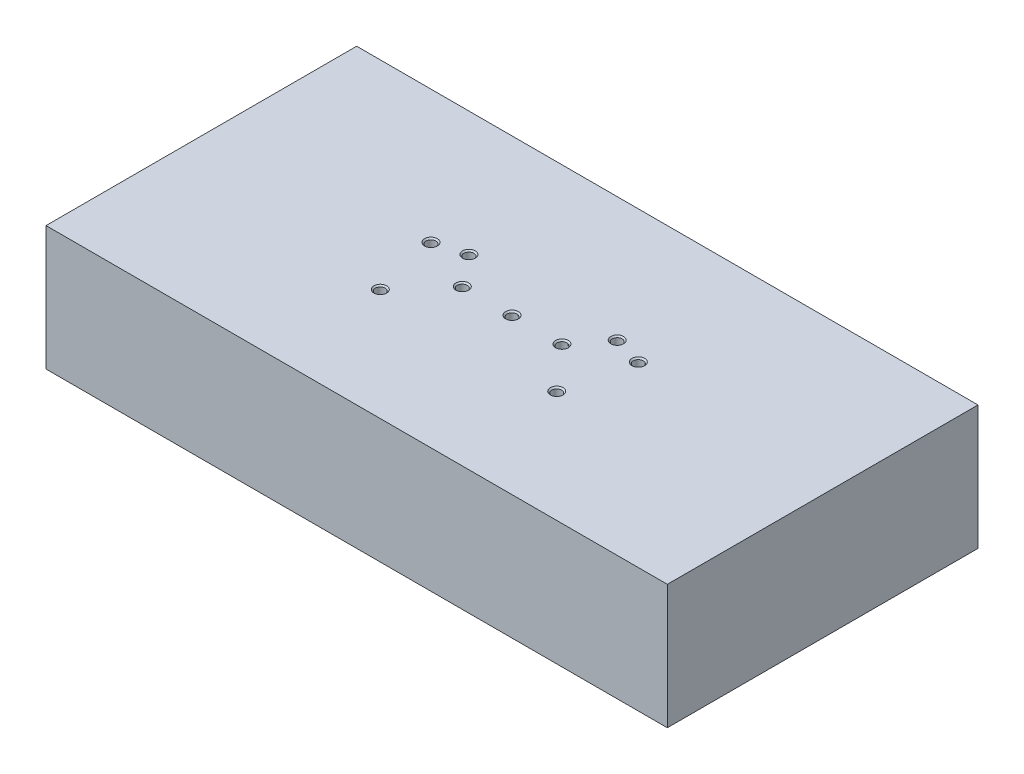
ISO-10303-21;
HEADER;
FILE_DESCRIPTION(('STEP AP214'),'2;1');
FILE_NAME('part.step','',(''),(''),'','','');
FILE_SCHEMA(('AUTOMOTIVE_DESIGN { 1 0 10303 214 1 1 1 1 }'));
ENDSEC;
DATA;
#1=APPLICATION_CONTEXT('core data for automotive mechanical design processes');
#2=APPLICATION_PROTOCOL_DEFINITION('international standard','automotive_design',2000,#1);
#3=PRODUCT_CONTEXT('',#1,'mechanical');
#4=PRODUCT('Part','Part','',(#3));
#5=PRODUCT_RELATED_PRODUCT_CATEGORY('part','',(#4));
#6=PRODUCT_DEFINITION_FORMATION('','',#4);
#7=PRODUCT_DEFINITION_CONTEXT('part definition',#1,'design');
#8=PRODUCT_DEFINITION('design','',#6,#7);
#9=PRODUCT_DEFINITION_SHAPE('','',#8);
#10=(LENGTH_UNIT() NAMED_UNIT(*) SI_UNIT(.MILLI.,.METRE.));
#11=(NAMED_UNIT(*) PLANE_ANGLE_UNIT() SI_UNIT($,.RADIAN.));
#12=(NAMED_UNIT(*) SI_UNIT($,.STERADIAN.) SOLID_ANGLE_UNIT());
#13=UNCERTAINTY_MEASURE_WITH_UNIT(LENGTH_MEASURE(1.E-05),#10,'distance_accuracy_value','');
#14=(GEOMETRIC_REPRESENTATION_CONTEXT(3) GLOBAL_UNCERTAINTY_ASSIGNED_CONTEXT((#13)) GLOBAL_UNIT_ASSIGNED_CONTEXT((#10,
#11,#12)) REPRESENTATION_CONTEXT('',''));
#15=CARTESIAN_POINT('',(0.,0.,0.));
#16=DIRECTION('',(0.,0.,1.));
#17=DIRECTION('',(1.,0.,0.));
#18=AXIS2_PLACEMENT_3D('',#15,#16,#17);
#19=CARTESIAN_POINT('',(-0.25,10.,0.));
#20=DIRECTION('',(1.,0.,0.));
#21=DIRECTION('',(0.,0.,-1.));
#22=AXIS2_PLACEMENT_3D('',#19,#20,#21);
#23=PLANE('',#22);
#24=DIRECTION('',(0.,0.,1.));
#25=VECTOR('',#24,1.);
#26=CARTESIAN_POINT('',(-0.25,0.,0.));
#27=LINE('',#26,#25);
#28=CARTESIAN_POINT('',(-0.250000000000001,0.,-7.));
#29=VERTEX_POINT('',#28);
#30=CARTESIAN_POINT('',(-0.25,0.,-3.));
#31=VERTEX_POINT('',#30);
#32=EDGE_CURVE('E178',#29,#31,#27,.T.);
#33=ORIENTED_EDGE('',*,*,#32,.F.);
#34=DIRECTION('',(0.,-1.,0.));
#35=VECTOR('',#34,1.);
#36=CARTESIAN_POINT('',(-0.250000000000001,10.,-7.));
#37=LINE('',#36,#35);
#38=CARTESIAN_POINT('',(-0.250000000000001,10.,-7.));
#39=VERTEX_POINT('',#38);
#40=EDGE_CURVE('E11',#39,#29,#37,.T.);
#41=ORIENTED_EDGE('',*,*,#40,.F.);
#42=DIRECTION('',(0.,0.,1.));
#43=VECTOR('',#42,1.);
#44=CARTESIAN_POINT('',(-0.25,10.,0.));
#45=LINE('',#44,#43);
#46=CARTESIAN_POINT('',(-0.25,10.,-3.));
#47=VERTEX_POINT('',#46);
#48=EDGE_CURVE('E198',#39,#47,#45,.T.);
#49=ORIENTED_EDGE('',*,*,#48,.T.);
#50=DIRECTION('',(0.,-1.,0.));
#51=VECTOR('',#50,1.);
#52=CARTESIAN_POINT('',(-0.25,10.,-3.));
#53=LINE('',#52,#51);
#54=EDGE_CURVE('E111',#47,#31,#53,.T.);
#55=ORIENTED_EDGE('',*,*,#54,.T.);
#56=EDGE_LOOP('',(#33,#41,#49,#55));
#57=FACE_BOUND('',#56,.T.);
#58=ADVANCED_FACE('F46',(#57),#23,.T.);
#59=CARTESIAN_POINT('',(0.,10.,-7.));
#60=DIRECTION('',(0.,0.,-1.));
#61=DIRECTION('',(-1.,0.,0.));
#62=AXIS2_PLACEMENT_3D('',#59,#60,#61);
#63=PLANE('',#62);
#64=DIRECTION('',(1.,0.,0.));
#65=VECTOR('',#64,1.);
#66=CARTESIAN_POINT('',(0.,0.,-7.));
#67=LINE('',#66,#65);
#68=CARTESIAN_POINT('',(0.249999999999999,0.,-7.));
#69=VERTEX_POINT('',#68);
#70=EDGE_CURVE('E181',#29,#69,#67,.T.);
#71=ORIENTED_EDGE('',*,*,#70,.T.);
#72=DIRECTION('',(0.,-1.,0.));
#73=VECTOR('',#72,1.);
#74=CARTESIAN_POINT('',(0.249999999999999,10.,-7.));
#75=LINE('',#74,#73);
#76=CARTESIAN_POINT('',(0.249999999999999,10.,-7.));
#77=VERTEX_POINT('',#76);
#78=EDGE_CURVE('E56',#77,#69,#75,.T.);
#79=ORIENTED_EDGE('',*,*,#78,.F.);
#80=DIRECTION('',(1.,0.,0.));
#81=VECTOR('',#80,1.);
#82=CARTESIAN_POINT('',(0.,10.,-7.));
#83=LINE('',#82,#81);
#84=EDGE_CURVE('E250',#39,#77,#83,.T.);
#85=ORIENTED_EDGE('',*,*,#84,.F.);
#86=ORIENTED_EDGE('',*,*,#40,.T.);
#87=EDGE_LOOP('',(#71,#79,#85,#86));
#88=FACE_BOUND('',#87,.T.);
#89=ADVANCED_FACE('F257',(#88),#63,.F.);
#90=CARTESIAN_POINT('',(0.25,10.,0.));
#91=DIRECTION('',(1.,0.,0.));
#92=DIRECTION('',(0.,0.,-1.));
#93=AXIS2_PLACEMENT_3D('',#90,#91,#92);
#94=PLANE('',#93);
#95=DIRECTION('',(0.,0.,1.));
#96=VECTOR('',#95,1.);
#97=CARTESIAN_POINT('',(0.25,0.,0.));
#98=LINE('',#97,#96);
#99=CARTESIAN_POINT('',(0.25,0.,-3.));
#100=VERTEX_POINT('',#99);
#101=EDGE_CURVE('E184',#69,#100,#98,.T.);
#102=ORIENTED_EDGE('',*,*,#101,.T.);
#103=DIRECTION('',(0.,-1.,0.));
#104=VECTOR('',#103,1.);
#105=CARTESIAN_POINT('',(0.25,10.,-3.));
#106=LINE('',#105,#104);
#107=CARTESIAN_POINT('',(0.25,10.,-3.));
#108=VERTEX_POINT('',#107);
#109=EDGE_CURVE('E204',#108,#100,#106,.T.);
#110=ORIENTED_EDGE('',*,*,#109,.F.);
#111=DIRECTION('',(0.,0.,1.));
#112=VECTOR('',#111,1.);
#113=CARTESIAN_POINT('',(0.25,10.,0.));
#114=LINE('',#113,#112);
#115=EDGE_CURVE('E156',#77,#108,#114,.T.);
#116=ORIENTED_EDGE('',*,*,#115,.F.);
#117=ORIENTED_EDGE('',*,*,#78,.T.);
#118=EDGE_LOOP('',(#102,#110,#116,#117));
#119=FACE_BOUND('',#118,.T.);
#120=ADVANCED_FACE('F255',(#119),#94,.F.);
#121=CARTESIAN_POINT('',(0.,10.,-3.));
#122=DIRECTION('',(0.,0.,-1.));
#123=DIRECTION('',(-1.,0.,0.));
#124=AXIS2_PLACEMENT_3D('',#121,#122,#123);
#125=PLANE('',#124);
#126=DIRECTION('',(1.,0.,0.));
#127=VECTOR('',#126,1.);
#128=CARTESIAN_POINT('',(0.,0.,-3.));
#129=LINE('',#128,#127);
#130=CARTESIAN_POINT('',(11.7,0.,-3.));
#131=VERTEX_POINT('',#130);
#132=EDGE_CURVE('E187',#100,#131,#129,.T.);
#133=ORIENTED_EDGE('',*,*,#132,.T.);
#134=DIRECTION('',(0.,-1.,0.));
#135=VECTOR('',#134,1.);
#136=CARTESIAN_POINT('',(11.7,10.,-3.));
#137=LINE('',#136,#135);
#138=CARTESIAN_POINT('',(11.7,10.,-3.));
#139=VERTEX_POINT('',#138);
#140=EDGE_CURVE('E140',#139,#131,#137,.T.);
#141=ORIENTED_EDGE('',*,*,#140,.F.);
#142=DIRECTION('',(1.,0.,0.));
#143=VECTOR('',#142,1.);
#144=CARTESIAN_POINT('',(0.,10.,-3.));
#145=LINE('',#144,#143);
#146=EDGE_CURVE('E154',#108,#139,#145,.T.);
#147=ORIENTED_EDGE('',*,*,#146,.F.);
#148=ORIENTED_EDGE('',*,*,#109,.T.);
#149=EDGE_LOOP('',(#133,#141,#147,#148));
#150=FACE_BOUND('',#149,.T.);
#151=ADVANCED_FACE('F307',(#150),#125,.F.);
#152=CARTESIAN_POINT('',(11.7,10.,0.));
#153=DIRECTION('',(1.,0.,0.));
#154=DIRECTION('',(0.,0.,-1.));
#155=AXIS2_PLACEMENT_3D('',#152,#153,#154);
#156=PLANE('',#155);
#157=DIRECTION('',(0.,0.,1.));
#158=VECTOR('',#157,1.);
#159=CARTESIAN_POINT('',(11.7,0.,0.));
#160=LINE('',#159,#158);
#161=CARTESIAN_POINT('',(11.7,0.,3.));
#162=VERTEX_POINT('',#161);
#163=EDGE_CURVE('E136',#131,#162,#160,.T.);
#164=ORIENTED_EDGE('',*,*,#163,.T.);
#165=DIRECTION('',(0.,-1.,0.));
#166=VECTOR('',#165,1.);
#167=CARTESIAN_POINT('',(11.7,10.,3.));
#168=LINE('',#167,#166);
#169=CARTESIAN_POINT('',(11.7,10.,3.));
#170=VERTEX_POINT('',#169);
#171=EDGE_CURVE('E129',#170,#162,#168,.T.);
#172=ORIENTED_EDGE('',*,*,#171,.F.);
#173=DIRECTION('',(0.,0.,1.));
#174=VECTOR('',#173,1.);
#175=CARTESIAN_POINT('',(11.7,10.,0.));
#176=LINE('',#175,#174);
#177=EDGE_CURVE('E134',#139,#170,#176,.T.);
#178=ORIENTED_EDGE('',*,*,#177,.F.);
#179=ORIENTED_EDGE('',*,*,#140,.T.);
#180=EDGE_LOOP('',(#164,#172,#178,#179));
#181=FACE_BOUND('',#180,.T.);
#182=ADVANCED_FACE('F131',(#181),#156,.F.);
#183=CARTESIAN_POINT('',(0.,10.,3.));
#184=DIRECTION('',(0.,0.,-1.));
#185=DIRECTION('',(-1.,0.,0.));
#186=AXIS2_PLACEMENT_3D('',#183,#184,#185);
#187=PLANE('',#186);
#188=DIRECTION('',(1.,0.,0.));
#189=VECTOR('',#188,1.);
#190=CARTESIAN_POINT('',(0.,0.,3.));
#191=LINE('',#190,#189);
#192=CARTESIAN_POINT('',(-11.7,0.,3.));
#193=VERTEX_POINT('',#192);
#194=EDGE_CURVE('E191',#193,#162,#191,.T.);
#195=ORIENTED_EDGE('',*,*,#194,.F.);
#196=DIRECTION('',(0.,-1.,0.));
#197=VECTOR('',#196,1.);
#198=CARTESIAN_POINT('',(-11.7,10.,3.));
#199=LINE('',#198,#197);
#200=CARTESIAN_POINT('',(-11.7,10.,3.));
#201=VERTEX_POINT('',#200);
#202=EDGE_CURVE('E141',#201,#193,#199,.T.);
#203=ORIENTED_EDGE('',*,*,#202,.F.);
#204=DIRECTION('',(1.,0.,0.));
#205=VECTOR('',#204,1.);
#206=CARTESIAN_POINT('',(0.,10.,3.));
#207=LINE('',#206,#205);
#208=EDGE_CURVE('E144',#201,#170,#207,.T.);
#209=ORIENTED_EDGE('',*,*,#208,.T.);
#210=ORIENTED_EDGE('',*,*,#171,.T.);
#211=EDGE_LOOP('',(#195,#203,#209,#210));
#212=FACE_BOUND('',#211,.T.);
#213=ADVANCED_FACE('F145',(#212),#187,.T.);
#214=CARTESIAN_POINT('',(-11.7,10.,0.));
#215=DIRECTION('',(1.,0.,0.));
#216=DIRECTION('',(0.,0.,-1.));
#217=AXIS2_PLACEMENT_3D('',#214,#215,#216);
#218=PLANE('',#217);
#219=DIRECTION('',(0.,0.,1.));
#220=VECTOR('',#219,1.);
#221=CARTESIAN_POINT('',(-11.7,0.,0.));
#222=LINE('',#221,#220);
#223=CARTESIAN_POINT('',(-11.7,0.,-3.));
#224=VERTEX_POINT('',#223);
#225=EDGE_CURVE('E193',#224,#193,#222,.T.);
#226=ORIENTED_EDGE('',*,*,#225,.F.);
#227=DIRECTION('',(0.,-1.,0.));
#228=VECTOR('',#227,1.);
#229=CARTESIAN_POINT('',(-11.7,10.,-3.));
#230=LINE('',#229,#228);
#231=CARTESIAN_POINT('',(-11.7,10.,-3.));
#232=VERTEX_POINT('',#231);
#233=EDGE_CURVE('E65',#232,#224,#230,.T.);
#234=ORIENTED_EDGE('',*,*,#233,.F.);
#235=DIRECTION('',(0.,0.,1.));
#236=VECTOR('',#235,1.);
#237=CARTESIAN_POINT('',(-11.7,10.,0.));
#238=LINE('',#237,#236);
#239=EDGE_CURVE('E148',#232,#201,#238,.T.);
#240=ORIENTED_EDGE('',*,*,#239,.T.);
#241=ORIENTED_EDGE('',*,*,#202,.T.);
#242=EDGE_LOOP('',(#226,#234,#240,#241));
#243=FACE_BOUND('',#242,.T.);
#244=ADVANCED_FACE('F283',(#243),#218,.T.);
#245=CARTESIAN_POINT('',(0.,10.,25.));
#246=DIRECTION('',(0.,0.,-1.));
#247=DIRECTION('',(-1.,0.,0.));
#248=AXIS2_PLACEMENT_3D('',#245,#246,#247);
#249=PLANE('',#248);
#250=DIRECTION('',(1.,0.,0.));
#251=VECTOR('',#250,1.);
#252=CARTESIAN_POINT('',(0.,0.,25.));
#253=LINE('',#252,#251);
#254=CARTESIAN_POINT('',(-50.,0.,25.));
#255=VERTEX_POINT('',#254);
#256=CARTESIAN_POINT('',(50.,0.,25.));
#257=VERTEX_POINT('',#256);
#258=EDGE_CURVE('E165',#255,#257,#253,.T.);
#259=ORIENTED_EDGE('',*,*,#258,.T.);
#260=DIRECTION('',(0.,-1.,0.));
#261=VECTOR('',#260,1.);
#262=CARTESIAN_POINT('',(50.,10.,25.));
#263=LINE('',#262,#261);
#264=CARTESIAN_POINT('',(50.,20.,25.));
#265=VERTEX_POINT('',#264);
#266=EDGE_CURVE('E200',#265,#257,#263,.T.);
#267=ORIENTED_EDGE('',*,*,#266,.F.);
#268=DIRECTION('',(1.,0.,0.));
#269=VECTOR('',#268,1.);
#270=CARTESIAN_POINT('',(-50.,20.,25.));
#271=LINE('',#270,#269);
#272=CARTESIAN_POINT('',(-50.,20.,25.));
#273=VERTEX_POINT('',#272);
#274=EDGE_CURVE('E169',#273,#265,#271,.T.);
#275=ORIENTED_EDGE('',*,*,#274,.F.);
#276=DIRECTION('',(0.,-1.,0.));
#277=VECTOR('',#276,1.);
#278=CARTESIAN_POINT('',(-50.,10.,25.));
#279=LINE('',#278,#277);
#280=EDGE_CURVE('E164',#273,#255,#279,.T.);
#281=ORIENTED_EDGE('',*,*,#280,.T.);
#282=EDGE_LOOP('',(#259,#267,#275,#281));
#283=FACE_BOUND('',#282,.T.);
#284=ADVANCED_FACE('F48',(#283),#249,.F.);
#285=CARTESIAN_POINT('',(50.,10.,0.));
#286=DIRECTION('',(-1.,0.,0.));
#287=DIRECTION('',(0.,0.,1.));
#288=AXIS2_PLACEMENT_3D('',#285,#286,#287);
#289=PLANE('',#288);
#290=DIRECTION('',(0.,0.,-1.));
#291=VECTOR('',#290,1.);
#292=CARTESIAN_POINT('',(50.,0.,0.));
#293=LINE('',#292,#291);
#294=CARTESIAN_POINT('',(50.,0.,-25.));
#295=VERTEX_POINT('',#294);
#296=EDGE_CURVE('E168',#257,#295,#293,.T.);
#297=ORIENTED_EDGE('',*,*,#296,.T.);
#298=DIRECTION('',(0.,-1.,0.));
#299=VECTOR('',#298,1.);
#300=CARTESIAN_POINT('',(50.,10.,-25.));
#301=LINE('',#300,#299);
#302=CARTESIAN_POINT('',(50.,20.,-25.));
#303=VERTEX_POINT('',#302);
#304=EDGE_CURVE('E212',#303,#295,#301,.T.);
#305=ORIENTED_EDGE('',*,*,#304,.F.);
#306=DIRECTION('',(0.,0.,-1.));
#307=VECTOR('',#306,1.);
#308=CARTESIAN_POINT('',(50.,20.,-25.));
#309=LINE('',#308,#307);
#310=EDGE_CURVE('E218',#265,#303,#309,.T.);
#311=ORIENTED_EDGE('',*,*,#310,.F.);
#312=ORIENTED_EDGE('',*,*,#266,.T.);
#313=EDGE_LOOP('',(#297,#305,#311,#312));
#314=FACE_BOUND('',#313,.T.);
#315=ADVANCED_FACE('F276',(#314),#289,.F.);
#316=CARTESIAN_POINT('',(0.,10.,-25.));
#317=DIRECTION('',(0.,0.,-1.));
#318=DIRECTION('',(-1.,0.,0.));
#319=AXIS2_PLACEMENT_3D('',#316,#317,#318);
#320=PLANE('',#319);
#321=DIRECTION('',(1.,0.,0.));
#322=VECTOR('',#321,1.);
#323=CARTESIAN_POINT('',(0.,0.,-25.));
#324=LINE('',#323,#322);
#325=CARTESIAN_POINT('',(-50.,0.,-25.));
#326=VERTEX_POINT('',#325);
#327=EDGE_CURVE('E172',#326,#295,#324,.T.);
#328=ORIENTED_EDGE('',*,*,#327,.F.);
#329=DIRECTION('',(0.,-1.,0.));
#330=VECTOR('',#329,1.);
#331=CARTESIAN_POINT('',(-50.,10.,-25.));
#332=LINE('',#331,#330);
#333=CARTESIAN_POINT('',(-50.,20.,-25.));
#334=VERTEX_POINT('',#333);
#335=EDGE_CURVE('E210',#334,#326,#332,.T.);
#336=ORIENTED_EDGE('',*,*,#335,.F.);
#337=DIRECTION('',(-1.,0.,0.));
#338=VECTOR('',#337,1.);
#339=CARTESIAN_POINT('',(-50.,20.,-25.));
#340=LINE('',#339,#338);
#341=EDGE_CURVE('E241',#303,#334,#340,.T.);
#342=ORIENTED_EDGE('',*,*,#341,.F.);
#343=ORIENTED_EDGE('',*,*,#304,.T.);
#344=EDGE_LOOP('',(#328,#336,#342,#343));
#345=FACE_BOUND('',#344,.T.);
#346=ADVANCED_FACE('F273',(#345),#320,.T.);
#347=CARTESIAN_POINT('',(-50.,10.,0.));
#348=DIRECTION('',(-1.,0.,0.));
#349=DIRECTION('',(0.,0.,1.));
#350=AXIS2_PLACEMENT_3D('',#347,#348,#349);
#351=PLANE('',#350);
#352=DIRECTION('',(0.,0.,-1.));
#353=VECTOR('',#352,1.);
#354=CARTESIAN_POINT('',(-50.,0.,0.));
#355=LINE('',#354,#353);
#356=EDGE_CURVE('E175',#255,#326,#355,.T.);
#357=ORIENTED_EDGE('',*,*,#356,.F.);
#358=ORIENTED_EDGE('',*,*,#280,.F.);
#359=DIRECTION('',(0.,0.,1.));
#360=VECTOR('',#359,1.);
#361=CARTESIAN_POINT('',(-50.,20.,-25.));
#362=LINE('',#361,#360);
#363=EDGE_CURVE('E244',#334,#273,#362,.T.);
#364=ORIENTED_EDGE('',*,*,#363,.F.);
#365=ORIENTED_EDGE('',*,*,#335,.T.);
#366=EDGE_LOOP('',(#357,#358,#364,#365));
#367=FACE_BOUND('',#366,.T.);
#368=ADVANCED_FACE('F269',(#367),#351,.T.);
#369=CARTESIAN_POINT('',(0.,10.,-3.));
#370=DIRECTION('',(0.,0.,-1.));
#371=DIRECTION('',(-1.,0.,0.));
#372=AXIS2_PLACEMENT_3D('',#369,#370,#371);
#373=PLANE('',#372);
#374=DIRECTION('',(1.,0.,0.));
#375=VECTOR('',#374,1.);
#376=CARTESIAN_POINT('',(0.,0.,-3.));
#377=LINE('',#376,#375);
#378=EDGE_CURVE('E196',#224,#31,#377,.T.);
#379=ORIENTED_EDGE('',*,*,#378,.T.);
#380=ORIENTED_EDGE('',*,*,#54,.F.);
#381=DIRECTION('',(1.,0.,0.));
#382=VECTOR('',#381,1.);
#383=CARTESIAN_POINT('',(0.,10.,-3.));
#384=LINE('',#383,#382);
#385=EDGE_CURVE('E161',#232,#47,#384,.T.);
#386=ORIENTED_EDGE('',*,*,#385,.F.);
#387=ORIENTED_EDGE('',*,*,#233,.T.);
#388=EDGE_LOOP('',(#379,#380,#386,#387));
#389=FACE_BOUND('',#388,.T.);
#390=ADVANCED_FACE('F272',(#389),#373,.F.);
#391=CARTESIAN_POINT('',(0.,0.,0.));
#392=DIRECTION('',(0.,1.,0.));
#393=DIRECTION('',(0.,0.,1.));
#394=AXIS2_PLACEMENT_3D('',#391,#392,#393);
#395=PLANE('',#394);
#396=CARTESIAN_POINT('',(-16.6850841666538,0.,-3.64352477404472));
#397=DIRECTION('',(0.,1.,0.));
#398=DIRECTION('',(0.,0.,1.));
#399=AXIS2_PLACEMENT_3D('',#396,#397,#398);
#400=CIRCLE('',#399,0.799999999999999);
#401=CARTESIAN_POINT('',(-16.6850841666538,0.,-2.84352477404472));
#402=VERTEX_POINT('',#401);
#403=EDGE_CURVE('E411',#402,#402,#400,.T.);
#404=ORIENTED_EDGE('',*,*,#403,.T.);
#405=EDGE_LOOP('',(#404));
#406=FACE_BOUND('',#405,.T.);
#407=CARTESIAN_POINT('',(-11.9350841666538,0.,-5.));
#408=DIRECTION('',(0.,1.,0.));
#409=DIRECTION('',(0.,0.,1.));
#410=AXIS2_PLACEMENT_3D('',#407,#408,#409);
#411=CIRCLE('',#410,0.799999999999997);
#412=CARTESIAN_POINT('',(-11.9350841666538,0.,-4.2));
#413=VERTEX_POINT('',#412);
#414=EDGE_CURVE('E422',#413,#413,#411,.T.);
#415=ORIENTED_EDGE('',*,*,#414,.T.);
#416=EDGE_LOOP('',(#415));
#417=FACE_BOUND('',#416,.T.);
#418=CARTESIAN_POINT('',(11.9350841666538,0.,-5.));
#419=DIRECTION('',(0.,1.,0.));
#420=DIRECTION('',(0.,0.,1.));
#421=AXIS2_PLACEMENT_3D('',#418,#419,#420);
#422=CIRCLE('',#421,0.799999999999997);
#423=CARTESIAN_POINT('',(11.9350841666538,0.,-4.2));
#424=VERTEX_POINT('',#423);
#425=EDGE_CURVE('E431',#424,#424,#422,.T.);
#426=ORIENTED_EDGE('',*,*,#425,.T.);
#427=EDGE_LOOP('',(#426));
#428=FACE_BOUND('',#427,.T.);
#429=CARTESIAN_POINT('',(16.6850841666538,0.,-3.64352477404472));
#430=DIRECTION('',(0.,1.,0.));
#431=DIRECTION('',(0.,0.,1.));
#432=AXIS2_PLACEMENT_3D('',#429,#430,#431);
#433=CIRCLE('',#432,0.799999999999999);
#434=CARTESIAN_POINT('',(16.6850841666538,0.,-2.84352477404472));
#435=VERTEX_POINT('',#434);
#436=EDGE_CURVE('E440',#435,#435,#433,.T.);
#437=ORIENTED_EDGE('',*,*,#436,.T.);
#438=EDGE_LOOP('',(#437));
#439=FACE_BOUND('',#438,.T.);
#440=CARTESIAN_POINT('',(14.2,0.,7.));
#441=DIRECTION('',(0.,1.,0.));
#442=DIRECTION('',(0.,0.,1.));
#443=AXIS2_PLACEMENT_3D('',#440,#441,#442);
#444=CIRCLE('',#443,0.799999999999997);
#445=CARTESIAN_POINT('',(14.2,0.,7.79999999999999));
#446=VERTEX_POINT('',#445);
#447=EDGE_CURVE('E449',#446,#446,#444,.T.);
#448=ORIENTED_EDGE('',*,*,#447,.T.);
#449=EDGE_LOOP('',(#448));
#450=FACE_BOUND('',#449,.T.);
#451=CARTESIAN_POINT('',(-14.2,0.,7.));
#452=DIRECTION('',(0.,1.,0.));
#453=DIRECTION('',(0.,0.,1.));
#454=AXIS2_PLACEMENT_3D('',#451,#452,#453);
#455=CIRCLE('',#454,0.799999999999997);
#456=CARTESIAN_POINT('',(-14.2,0.,7.8));
#457=VERTEX_POINT('',#456);
#458=EDGE_CURVE('E458',#457,#457,#455,.T.);
#459=ORIENTED_EDGE('',*,*,#458,.T.);
#460=EDGE_LOOP('',(#459));
#461=FACE_BOUND('',#460,.T.);
#462=ORIENTED_EDGE('',*,*,#258,.F.);
#463=ORIENTED_EDGE('',*,*,#356,.T.);
#464=ORIENTED_EDGE('',*,*,#327,.T.);
#465=ORIENTED_EDGE('',*,*,#296,.F.);
#466=EDGE_LOOP('',(#462,#463,#464,#465));
#467=FACE_BOUND('',#466,.T.);
#468=ORIENTED_EDGE('',*,*,#32,.T.);
#469=ORIENTED_EDGE('',*,*,#378,.F.);
#470=ORIENTED_EDGE('',*,*,#225,.T.);
#471=ORIENTED_EDGE('',*,*,#194,.T.);
#472=ORIENTED_EDGE('',*,*,#163,.F.);
#473=ORIENTED_EDGE('',*,*,#132,.F.);
#474=ORIENTED_EDGE('',*,*,#101,.F.);
#475=ORIENTED_EDGE('',*,*,#70,.F.);
#476=EDGE_LOOP('',(#468,#469,#470,#471,#472,#473,#474,#475));
#477=FACE_BOUND('',#476,.T.);
#478=ADVANCED_FACE('F260',(#406,#417,#428,#439,#450,#461,#467,#477),#395,.F.);
#479=CARTESIAN_POINT('',(0.,10.,0.));
#480=DIRECTION('',(0.,1.,0.));
#481=DIRECTION('',(0.,0.,1.));
#482=AXIS2_PLACEMENT_3D('',#479,#480,#481);
#483=PLANE('',#482);
#484=CARTESIAN_POINT('',(-8.,10.,0.));
#485=DIRECTION('',(0.,1.,0.));
#486=DIRECTION('',(0.,0.,1.));
#487=AXIS2_PLACEMENT_3D('',#484,#485,#486);
#488=CIRCLE('',#487,0.799999999999999);
#489=CARTESIAN_POINT('',(-8.,10.,0.799999999999999));
#490=VERTEX_POINT('',#489);
#491=EDGE_CURVE('E50',#490,#490,#488,.T.);
#492=ORIENTED_EDGE('',*,*,#491,.T.);
#493=EDGE_LOOP('',(#492));
#494=FACE_BOUND('',#493,.T.);
#495=CARTESIAN_POINT('',(8.04263175425321,10.,0.));
#496=DIRECTION('',(0.,1.,0.));
#497=DIRECTION('',(0.,0.,1.));
#498=AXIS2_PLACEMENT_3D('',#495,#496,#497);
#499=CIRCLE('',#498,0.799999999999999);
#500=CARTESIAN_POINT('',(8.04263175425321,10.,0.799999999999999));
#501=VERTEX_POINT('',#500);
#502=EDGE_CURVE('E220',#501,#501,#499,.T.);
#503=ORIENTED_EDGE('',*,*,#502,.T.);
#504=EDGE_LOOP('',(#503));
#505=FACE_BOUND('',#504,.T.);
#506=CARTESIAN_POINT('',(0.,10.,0.));
#507=DIRECTION('',(0.,1.,0.));
#508=DIRECTION('',(0.,0.,1.));
#509=AXIS2_PLACEMENT_3D('',#506,#507,#508);
#510=CIRCLE('',#509,0.799999999999998);
#511=CARTESIAN_POINT('',(0.,10.,0.799999999999998));
#512=VERTEX_POINT('',#511);
#513=EDGE_CURVE('E216',#512,#512,#510,.T.);
#514=ORIENTED_EDGE('',*,*,#513,.T.);
#515=EDGE_LOOP('',(#514));
#516=FACE_BOUND('',#515,.T.);
#517=ORIENTED_EDGE('',*,*,#48,.F.);
#518=ORIENTED_EDGE('',*,*,#84,.T.);
#519=ORIENTED_EDGE('',*,*,#115,.T.);
#520=ORIENTED_EDGE('',*,*,#146,.T.);
#521=ORIENTED_EDGE('',*,*,#177,.T.);
#522=ORIENTED_EDGE('',*,*,#208,.F.);
#523=ORIENTED_EDGE('',*,*,#239,.F.);
#524=ORIENTED_EDGE('',*,*,#385,.T.);
#525=EDGE_LOOP('',(#517,#518,#519,#520,#521,#522,#523,#524));
#526=FACE_BOUND('',#525,.T.);
#527=ADVANCED_FACE('F152',(#494,#505,#516,#526),#483,.F.);
#528=CARTESIAN_POINT('',(0.,20.,0.));
#529=DIRECTION('',(0.,1.,0.));
#530=DIRECTION('',(0.,0.,1.));
#531=AXIS2_PLACEMENT_3D('',#528,#529,#530);
#532=PLANE('',#531);
#533=CARTESIAN_POINT('',(-16.6850841666538,20.,-3.64352477404472));
#534=DIRECTION('',(0.,1.,0.));
#535=DIRECTION('',(0.,0.,1.));
#536=AXIS2_PLACEMENT_3D('',#533,#534,#535);
#537=CIRCLE('',#536,1.025);
#538=CARTESIAN_POINT('',(-16.6850841666538,20.,-2.61852477404472));
#539=VERTEX_POINT('',#538);
#540=EDGE_CURVE('E409',#539,#539,#537,.T.);
#541=ORIENTED_EDGE('',*,*,#540,.F.);
#542=EDGE_LOOP('',(#541));
#543=FACE_BOUND('',#542,.T.);
#544=CARTESIAN_POINT('',(-11.9350841666538,20.,-5.));
#545=DIRECTION('',(0.,1.,0.));
#546=DIRECTION('',(0.,0.,1.));
#547=AXIS2_PLACEMENT_3D('',#544,#545,#546);
#548=CIRCLE('',#547,1.025);
#549=CARTESIAN_POINT('',(-11.9350841666538,20.,-3.975));
#550=VERTEX_POINT('',#549);
#551=EDGE_CURVE('E416',#550,#550,#548,.T.);
#552=ORIENTED_EDGE('',*,*,#551,.F.);
#553=EDGE_LOOP('',(#552));
#554=FACE_BOUND('',#553,.T.);
#555=CARTESIAN_POINT('',(11.9350841666538,20.,-5.));
#556=DIRECTION('',(0.,1.,0.));
#557=DIRECTION('',(0.,0.,1.));
#558=AXIS2_PLACEMENT_3D('',#555,#556,#557);
#559=CIRCLE('',#558,1.025);
#560=CARTESIAN_POINT('',(11.9350841666538,20.,-3.975));
#561=VERTEX_POINT('',#560);
#562=EDGE_CURVE('E425',#561,#561,#559,.T.);
#563=ORIENTED_EDGE('',*,*,#562,.F.);
#564=EDGE_LOOP('',(#563));
#565=FACE_BOUND('',#564,.T.);
#566=CARTESIAN_POINT('',(16.6850841666538,20.,-3.64352477404472));
#567=DIRECTION('',(0.,1.,0.));
#568=DIRECTION('',(0.,0.,1.));
#569=AXIS2_PLACEMENT_3D('',#566,#567,#568);
#570=CIRCLE('',#569,1.025);
#571=CARTESIAN_POINT('',(16.6850841666538,20.,-2.61852477404472));
#572=VERTEX_POINT('',#571);
#573=EDGE_CURVE('E434',#572,#572,#570,.T.);
#574=ORIENTED_EDGE('',*,*,#573,.F.);
#575=EDGE_LOOP('',(#574));
#576=FACE_BOUND('',#575,.T.);
#577=CARTESIAN_POINT('',(14.2,20.,7.));
#578=DIRECTION('',(0.,1.,0.));
#579=DIRECTION('',(0.,0.,1.));
#580=AXIS2_PLACEMENT_3D('',#577,#578,#579);
#581=CIRCLE('',#580,1.025);
#582=CARTESIAN_POINT('',(14.2,20.,8.025));
#583=VERTEX_POINT('',#582);
#584=EDGE_CURVE('E443',#583,#583,#581,.T.);
#585=ORIENTED_EDGE('',*,*,#584,.F.);
#586=EDGE_LOOP('',(#585));
#587=FACE_BOUND('',#586,.T.);
#588=CARTESIAN_POINT('',(-14.2,20.,7.));
#589=DIRECTION('',(0.,1.,0.));
#590=DIRECTION('',(0.,0.,1.));
#591=AXIS2_PLACEMENT_3D('',#588,#589,#590);
#592=CIRCLE('',#591,1.025);
#593=CARTESIAN_POINT('',(-14.2,20.,8.025));
#594=VERTEX_POINT('',#593);
#595=EDGE_CURVE('E452',#594,#594,#592,.T.);
#596=ORIENTED_EDGE('',*,*,#595,.F.);
#597=EDGE_LOOP('',(#596));
#598=FACE_BOUND('',#597,.T.);
#599=CARTESIAN_POINT('',(-8.,20.,0.));
#600=DIRECTION('',(0.,1.,0.));
#601=DIRECTION('',(0.,0.,1.));
#602=AXIS2_PLACEMENT_3D('',#599,#600,#601);
#603=CIRCLE('',#602,1.025);
#604=CARTESIAN_POINT('',(-8.,20.,1.025));
#605=VERTEX_POINT('',#604);
#606=EDGE_CURVE('E461',#605,#605,#603,.T.);
#607=ORIENTED_EDGE('',*,*,#606,.F.);
#608=EDGE_LOOP('',(#607));
#609=FACE_BOUND('',#608,.T.);
#610=CARTESIAN_POINT('',(8.04263175425321,20.,0.));
#611=DIRECTION('',(0.,1.,0.));
#612=DIRECTION('',(0.,0.,1.));
#613=AXIS2_PLACEMENT_3D('',#610,#611,#612);
#614=CIRCLE('',#613,1.025);
#615=CARTESIAN_POINT('',(8.04263175425321,20.,1.025));
#616=VERTEX_POINT('',#615);
#617=EDGE_CURVE('E229',#616,#616,#614,.T.);
#618=ORIENTED_EDGE('',*,*,#617,.F.);
#619=EDGE_LOOP('',(#618));
#620=FACE_BOUND('',#619,.T.);
#621=CARTESIAN_POINT('',(0.,20.,0.));
#622=DIRECTION('',(0.,1.,0.));
#623=DIRECTION('',(0.,0.,1.));
#624=AXIS2_PLACEMENT_3D('',#621,#622,#623);
#625=CIRCLE('',#624,1.025);
#626=CARTESIAN_POINT('',(0.,20.,1.025));
#627=VERTEX_POINT('',#626);
#628=EDGE_CURVE('E222',#627,#627,#625,.T.);
#629=ORIENTED_EDGE('',*,*,#628,.F.);
#630=EDGE_LOOP('',(#629));
#631=FACE_BOUND('',#630,.T.);
#632=ORIENTED_EDGE('',*,*,#310,.T.);
#633=ORIENTED_EDGE('',*,*,#341,.T.);
#634=ORIENTED_EDGE('',*,*,#363,.T.);
#635=ORIENTED_EDGE('',*,*,#274,.T.);
#636=EDGE_LOOP('',(#632,#633,#634,#635));
#637=FACE_BOUND('',#636,.T.);
#638=ADVANCED_FACE('F299',(#543,#554,#565,#576,#587,#598,#609,#620,#631,#637),#532,.T.);
#639=CARTESIAN_POINT('',(0.,20.,0.));
#640=DIRECTION('',(0.,1.,0.));
#641=DIRECTION('',(0.,0.,1.));
#642=AXIS2_PLACEMENT_3D('',#639,#640,#641);
#643=CYLINDRICAL_SURFACE('',#642,0.799999999999998);
#644=CARTESIAN_POINT('',(0.,19.775,0.));
#645=DIRECTION('',(0.,1.,0.));
#646=DIRECTION('',(0.,0.,1.));
#647=AXIS2_PLACEMENT_3D('',#644,#645,#646);
#648=CIRCLE('',#647,0.8);
#649=CARTESIAN_POINT('',(0.,19.775,0.8));
#650=VERTEX_POINT('',#649);
#651=EDGE_CURVE('E219',#650,#650,#648,.T.);
#652=ORIENTED_EDGE('',*,*,#651,.T.);
#653=EDGE_LOOP('',(#652));
#654=FACE_BOUND('',#653,.T.);
#655=ORIENTED_EDGE('',*,*,#513,.F.);
#656=EDGE_LOOP('',(#655));
#657=FACE_BOUND('',#656,.T.);
#658=ADVANCED_FACE('F330',(#654,#657),#643,.F.);
#659=CARTESIAN_POINT('',(0.,20.,0.));
#660=DIRECTION('',(0.,1.,0.));
#661=DIRECTION('',(0.,0.,1.));
#662=AXIS2_PLACEMENT_3D('',#659,#660,#661);
#663=CONICAL_SURFACE('',#662,1.025,0.785398163397449);
#664=ORIENTED_EDGE('',*,*,#651,.F.);
#665=EDGE_LOOP('',(#664));
#666=FACE_BOUND('',#665,.T.);
#667=ORIENTED_EDGE('',*,*,#628,.T.);
#668=EDGE_LOOP('',(#667));
#669=FACE_BOUND('',#668,.T.);
#670=ADVANCED_FACE('F334',(#666,#669),#663,.F.);
#671=CARTESIAN_POINT('',(8.04263175425321,20.,0.));
#672=DIRECTION('',(0.,1.,0.));
#673=DIRECTION('',(0.,0.,1.));
#674=AXIS2_PLACEMENT_3D('',#671,#672,#673);
#675=CYLINDRICAL_SURFACE('',#674,0.799999999999999);
#676=CARTESIAN_POINT('',(8.04263175425321,19.775,0.));
#677=DIRECTION('',(0.,1.,0.));
#678=DIRECTION('',(0.,0.,1.));
#679=AXIS2_PLACEMENT_3D('',#676,#677,#678);
#680=CIRCLE('',#679,0.8);
#681=CARTESIAN_POINT('',(8.04263175425321,19.775,0.8));
#682=VERTEX_POINT('',#681);
#683=EDGE_CURVE('E223',#682,#682,#680,.T.);
#684=ORIENTED_EDGE('',*,*,#683,.T.);
#685=EDGE_LOOP('',(#684));
#686=FACE_BOUND('',#685,.T.);
#687=ORIENTED_EDGE('',*,*,#502,.F.);
#688=EDGE_LOOP('',(#687));
#689=FACE_BOUND('',#688,.T.);
#690=ADVANCED_FACE('F338',(#686,#689),#675,.F.);
#691=CARTESIAN_POINT('',(8.04263175425321,20.,0.));
#692=DIRECTION('',(0.,1.,0.));
#693=DIRECTION('',(0.,0.,1.));
#694=AXIS2_PLACEMENT_3D('',#691,#692,#693);
#695=CONICAL_SURFACE('',#694,1.025,0.785398163397448);
#696=ORIENTED_EDGE('',*,*,#683,.F.);
#697=EDGE_LOOP('',(#696));
#698=FACE_BOUND('',#697,.T.);
#699=ORIENTED_EDGE('',*,*,#617,.T.);
#700=EDGE_LOOP('',(#699));
#701=FACE_BOUND('',#700,.T.);
#702=ADVANCED_FACE('F342',(#698,#701),#695,.F.);
#703=CARTESIAN_POINT('',(-8.,20.,0.));
#704=DIRECTION('',(0.,1.,0.));
#705=DIRECTION('',(0.,0.,1.));
#706=AXIS2_PLACEMENT_3D('',#703,#704,#705);
#707=CYLINDRICAL_SURFACE('',#706,0.799999999999999);
#708=CARTESIAN_POINT('',(-8.,19.775,0.));
#709=DIRECTION('',(0.,1.,0.));
#710=DIRECTION('',(0.,0.,1.));
#711=AXIS2_PLACEMENT_3D('',#708,#709,#710);
#712=CIRCLE('',#711,0.8);
#713=CARTESIAN_POINT('',(-8.,19.775,0.8));
#714=VERTEX_POINT('',#713);
#715=EDGE_CURVE('E463',#714,#714,#712,.T.);
#716=ORIENTED_EDGE('',*,*,#715,.T.);
#717=EDGE_LOOP('',(#716));
#718=FACE_BOUND('',#717,.T.);
#719=ORIENTED_EDGE('',*,*,#491,.F.);
#720=EDGE_LOOP('',(#719));
#721=FACE_BOUND('',#720,.T.);
#722=ADVANCED_FACE('F345',(#718,#721),#707,.F.);
#723=CARTESIAN_POINT('',(-8.,20.,0.));
#724=DIRECTION('',(0.,1.,0.));
#725=DIRECTION('',(0.,0.,1.));
#726=AXIS2_PLACEMENT_3D('',#723,#724,#725);
#727=CONICAL_SURFACE('',#726,1.025,0.785398163397448);
#728=ORIENTED_EDGE('',*,*,#715,.F.);
#729=EDGE_LOOP('',(#728));
#730=FACE_BOUND('',#729,.T.);
#731=ORIENTED_EDGE('',*,*,#606,.T.);
#732=EDGE_LOOP('',(#731));
#733=FACE_BOUND('',#732,.T.);
#734=ADVANCED_FACE('F349',(#730,#733),#727,.F.);
#735=CARTESIAN_POINT('',(-14.2,20.,7.));
#736=DIRECTION('',(0.,1.,0.));
#737=DIRECTION('',(0.,0.,1.));
#738=AXIS2_PLACEMENT_3D('',#735,#736,#737);
#739=CYLINDRICAL_SURFACE('',#738,0.799999999999999);
#740=ORIENTED_EDGE('',*,*,#458,.F.);
#741=EDGE_LOOP('',(#740));
#742=FACE_BOUND('',#741,.T.);
#743=CARTESIAN_POINT('',(-14.2,19.775,7.));
#744=DIRECTION('',(0.,1.,0.));
#745=DIRECTION('',(0.,0.,1.));
#746=AXIS2_PLACEMENT_3D('',#743,#744,#745);
#747=CIRCLE('',#746,0.8);
#748=CARTESIAN_POINT('',(-14.2,19.775,7.8));
#749=VERTEX_POINT('',#748);
#750=EDGE_CURVE('E455',#749,#749,#747,.T.);
#751=ORIENTED_EDGE('',*,*,#750,.T.);
#752=EDGE_LOOP('',(#751));
#753=FACE_BOUND('',#752,.T.);
#754=ADVANCED_FACE('F353',(#742,#753),#739,.F.);
#755=CARTESIAN_POINT('',(-14.2,20.,7.));
#756=DIRECTION('',(0.,1.,0.));
#757=DIRECTION('',(0.,0.,1.));
#758=AXIS2_PLACEMENT_3D('',#755,#756,#757);
#759=CONICAL_SURFACE('',#758,1.025,0.785398163397448);
#760=ORIENTED_EDGE('',*,*,#750,.F.);
#761=EDGE_LOOP('',(#760));
#762=FACE_BOUND('',#761,.T.);
#763=ORIENTED_EDGE('',*,*,#595,.T.);
#764=EDGE_LOOP('',(#763));
#765=FACE_BOUND('',#764,.T.);
#766=ADVANCED_FACE('F357',(#762,#765),#759,.F.);
#767=CARTESIAN_POINT('',(14.2,20.,7.));
#768=DIRECTION('',(0.,1.,0.));
#769=DIRECTION('',(0.,0.,1.));
#770=AXIS2_PLACEMENT_3D('',#767,#768,#769);
#771=CYLINDRICAL_SURFACE('',#770,0.799999999999999);
#772=ORIENTED_EDGE('',*,*,#447,.F.);
#773=EDGE_LOOP('',(#772));
#774=FACE_BOUND('',#773,.T.);
#775=CARTESIAN_POINT('',(14.2,19.775,7.));
#776=DIRECTION('',(0.,1.,0.));
#777=DIRECTION('',(0.,0.,1.));
#778=AXIS2_PLACEMENT_3D('',#775,#776,#777);
#779=CIRCLE('',#778,0.8);
#780=CARTESIAN_POINT('',(14.2,19.775,7.8));
#781=VERTEX_POINT('',#780);
#782=EDGE_CURVE('E446',#781,#781,#779,.T.);
#783=ORIENTED_EDGE('',*,*,#782,.T.);
#784=EDGE_LOOP('',(#783));
#785=FACE_BOUND('',#784,.T.);
#786=ADVANCED_FACE('F361',(#774,#785),#771,.F.);
#787=CARTESIAN_POINT('',(14.2,20.,7.));
#788=DIRECTION('',(0.,1.,0.));
#789=DIRECTION('',(0.,0.,1.));
#790=AXIS2_PLACEMENT_3D('',#787,#788,#789);
#791=CONICAL_SURFACE('',#790,1.025,0.785398163397448);
#792=ORIENTED_EDGE('',*,*,#782,.F.);
#793=EDGE_LOOP('',(#792));
#794=FACE_BOUND('',#793,.T.);
#795=ORIENTED_EDGE('',*,*,#584,.T.);
#796=EDGE_LOOP('',(#795));
#797=FACE_BOUND('',#796,.T.);
#798=ADVANCED_FACE('F365',(#794,#797),#791,.F.);
#799=CARTESIAN_POINT('',(16.6850841666538,20.,-3.64352477404472));
#800=DIRECTION('',(0.,1.,0.));
#801=DIRECTION('',(0.,0.,1.));
#802=AXIS2_PLACEMENT_3D('',#799,#800,#801);
#803=CYLINDRICAL_SURFACE('',#802,0.799999999999999);
#804=ORIENTED_EDGE('',*,*,#436,.F.);
#805=EDGE_LOOP('',(#804));
#806=FACE_BOUND('',#805,.T.);
#807=CARTESIAN_POINT('',(16.6850841666538,19.775,-3.64352477404472));
#808=DIRECTION('',(0.,1.,0.));
#809=DIRECTION('',(0.,0.,1.));
#810=AXIS2_PLACEMENT_3D('',#807,#808,#809);
#811=CIRCLE('',#810,0.799999999999999);
#812=CARTESIAN_POINT('',(16.6850841666538,19.775,-2.84352477404472));
#813=VERTEX_POINT('',#812);
#814=EDGE_CURVE('E437',#813,#813,#811,.T.);
#815=ORIENTED_EDGE('',*,*,#814,.T.);
#816=EDGE_LOOP('',(#815));
#817=FACE_BOUND('',#816,.T.);
#818=ADVANCED_FACE('F369',(#806,#817),#803,.F.);
#819=CARTESIAN_POINT('',(16.6850841666538,20.,-3.64352477404472));
#820=DIRECTION('',(0.,1.,0.));
#821=DIRECTION('',(0.,0.,1.));
#822=AXIS2_PLACEMENT_3D('',#819,#820,#821);
#823=CONICAL_SURFACE('',#822,1.025,0.785398163397456);
#824=ORIENTED_EDGE('',*,*,#814,.F.);
#825=EDGE_LOOP('',(#824));
#826=FACE_BOUND('',#825,.T.);
#827=ORIENTED_EDGE('',*,*,#573,.T.);
#828=EDGE_LOOP('',(#827));
#829=FACE_BOUND('',#828,.T.);
#830=ADVANCED_FACE('F373',(#826,#829),#823,.F.);
#831=CARTESIAN_POINT('',(11.9350841666538,20.,-5.));
#832=DIRECTION('',(0.,1.,0.));
#833=DIRECTION('',(0.,0.,1.));
#834=AXIS2_PLACEMENT_3D('',#831,#832,#833);
#835=CYLINDRICAL_SURFACE('',#834,0.799999999999999);
#836=ORIENTED_EDGE('',*,*,#425,.F.);
#837=EDGE_LOOP('',(#836));
#838=FACE_BOUND('',#837,.T.);
#839=CARTESIAN_POINT('',(11.9350841666538,19.775,-5.));
#840=DIRECTION('',(0.,1.,0.));
#841=DIRECTION('',(0.,0.,1.));
#842=AXIS2_PLACEMENT_3D('',#839,#840,#841);
#843=CIRCLE('',#842,0.8);
#844=CARTESIAN_POINT('',(11.9350841666538,19.775,-4.2));
#845=VERTEX_POINT('',#844);
#846=EDGE_CURVE('E428',#845,#845,#843,.T.);
#847=ORIENTED_EDGE('',*,*,#846,.T.);
#848=EDGE_LOOP('',(#847));
#849=FACE_BOUND('',#848,.T.);
#850=ADVANCED_FACE('F377',(#838,#849),#835,.F.);
#851=CARTESIAN_POINT('',(11.9350841666538,20.,-5.));
#852=DIRECTION('',(0.,1.,0.));
#853=DIRECTION('',(0.,0.,1.));
#854=AXIS2_PLACEMENT_3D('',#851,#852,#853);
#855=CONICAL_SURFACE('',#854,1.025,0.785398163397448);
#856=ORIENTED_EDGE('',*,*,#846,.F.);
#857=EDGE_LOOP('',(#856));
#858=FACE_BOUND('',#857,.T.);
#859=ORIENTED_EDGE('',*,*,#562,.T.);
#860=EDGE_LOOP('',(#859));
#861=FACE_BOUND('',#860,.T.);
#862=ADVANCED_FACE('F381',(#858,#861),#855,.F.);
#863=CARTESIAN_POINT('',(-11.9350841666538,20.,-5.));
#864=DIRECTION('',(0.,1.,0.));
#865=DIRECTION('',(0.,0.,1.));
#866=AXIS2_PLACEMENT_3D('',#863,#864,#865);
#867=CYLINDRICAL_SURFACE('',#866,0.799999999999999);
#868=ORIENTED_EDGE('',*,*,#414,.F.);
#869=EDGE_LOOP('',(#868));
#870=FACE_BOUND('',#869,.T.);
#871=CARTESIAN_POINT('',(-11.9350841666538,19.775,-5.));
#872=DIRECTION('',(0.,1.,0.));
#873=DIRECTION('',(0.,0.,1.));
#874=AXIS2_PLACEMENT_3D('',#871,#872,#873);
#875=CIRCLE('',#874,0.8);
#876=CARTESIAN_POINT('',(-11.9350841666538,19.775,-4.2));
#877=VERTEX_POINT('',#876);
#878=EDGE_CURVE('E419',#877,#877,#875,.T.);
#879=ORIENTED_EDGE('',*,*,#878,.T.);
#880=EDGE_LOOP('',(#879));
#881=FACE_BOUND('',#880,.T.);
#882=ADVANCED_FACE('F385',(#870,#881),#867,.F.);
#883=CARTESIAN_POINT('',(-11.9350841666538,20.,-5.));
#884=DIRECTION('',(0.,1.,0.));
#885=DIRECTION('',(0.,0.,1.));
#886=AXIS2_PLACEMENT_3D('',#883,#884,#885);
#887=CONICAL_SURFACE('',#886,1.025,0.785398163397448);
#888=ORIENTED_EDGE('',*,*,#878,.F.);
#889=EDGE_LOOP('',(#888));
#890=FACE_BOUND('',#889,.T.);
#891=ORIENTED_EDGE('',*,*,#551,.T.);
#892=EDGE_LOOP('',(#891));
#893=FACE_BOUND('',#892,.T.);
#894=ADVANCED_FACE('F389',(#890,#893),#887,.F.);
#895=CARTESIAN_POINT('',(-16.6850841666538,20.,-3.64352477404472));
#896=DIRECTION('',(0.,1.,0.));
#897=DIRECTION('',(0.,0.,1.));
#898=AXIS2_PLACEMENT_3D('',#895,#896,#897);
#899=CYLINDRICAL_SURFACE('',#898,0.799999999999999);
#900=ORIENTED_EDGE('',*,*,#403,.F.);
#901=EDGE_LOOP('',(#900));
#902=FACE_BOUND('',#901,.T.);
#903=CARTESIAN_POINT('',(-16.6850841666538,19.775,-3.64352477404472));
#904=DIRECTION('',(0.,1.,0.));
#905=DIRECTION('',(0.,0.,1.));
#906=AXIS2_PLACEMENT_3D('',#903,#904,#905);
#907=CIRCLE('',#906,0.799999999999999);
#908=CARTESIAN_POINT('',(-16.6850841666538,19.775,-2.84352477404472));
#909=VERTEX_POINT('',#908);
#910=EDGE_CURVE('E406',#909,#909,#907,.T.);
#911=ORIENTED_EDGE('',*,*,#910,.T.);
#912=EDGE_LOOP('',(#911));
#913=FACE_BOUND('',#912,.T.);
#914=ADVANCED_FACE('F393',(#902,#913),#899,.F.);
#915=CARTESIAN_POINT('',(-16.6850841666538,20.,-3.64352477404472));
#916=DIRECTION('',(0.,1.,0.));
#917=DIRECTION('',(0.,0.,1.));
#918=AXIS2_PLACEMENT_3D('',#915,#916,#917);
#919=CONICAL_SURFACE('',#918,1.025,0.785398163397456);
#920=ORIENTED_EDGE('',*,*,#910,.F.);
#921=EDGE_LOOP('',(#920));
#922=FACE_BOUND('',#921,.T.);
#923=ORIENTED_EDGE('',*,*,#540,.T.);
#924=EDGE_LOOP('',(#923));
#925=FACE_BOUND('',#924,.T.);
#926=ADVANCED_FACE('F397',(#922,#925),#919,.F.);
#927=CLOSED_SHELL('',(#58,#89,#120,#151,#182,#213,#244,#284,#315,#346,#368,#390,#478,#527,#638,
#658,#670,#690,#702,#722,#734,#754,#766,#786,#798,#818,#830,#850,#862,#882,#894,#914,#926));
#928=MANIFOLD_SOLID_BREP('B2',#927);
#929=ADVANCED_BREP_SHAPE_REPRESENTATION('',(#18,#928),#14);
#930=SHAPE_DEFINITION_REPRESENTATION(#9,#929);
ENDSEC;
END-ISO-10303-21;
